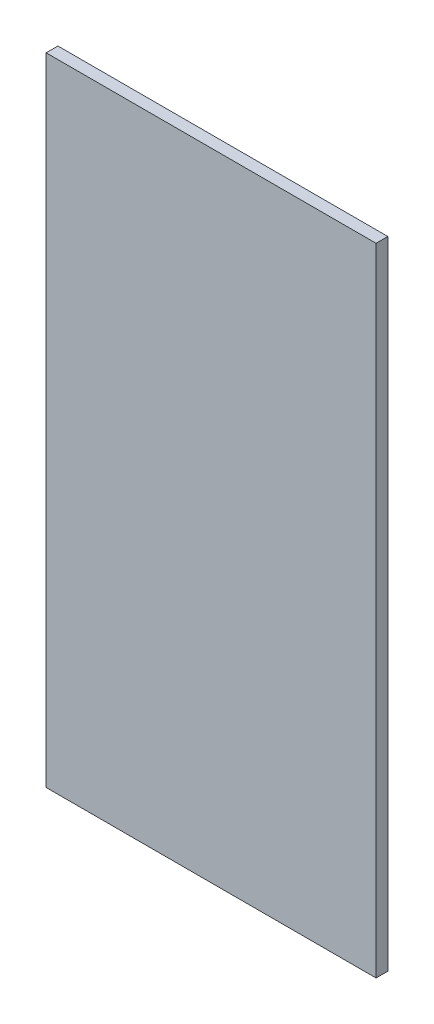
ISO-10303-21;
HEADER;
FILE_DESCRIPTION(('STEP AP214'),'2;1');
FILE_NAME('part.step','',(''),(''),'','','');
FILE_SCHEMA(('AUTOMOTIVE_DESIGN { 1 0 10303 214 1 1 1 1 }'));
ENDSEC;
DATA;
#1=APPLICATION_CONTEXT('core data for automotive mechanical design processes');
#2=APPLICATION_PROTOCOL_DEFINITION('international standard','automotive_design',2000,#1);
#3=PRODUCT_CONTEXT('',#1,'mechanical');
#4=PRODUCT('Part','Part','',(#3));
#5=PRODUCT_RELATED_PRODUCT_CATEGORY('part','',(#4));
#6=PRODUCT_DEFINITION_FORMATION('','',#4);
#7=PRODUCT_DEFINITION_CONTEXT('part definition',#1,'design');
#8=PRODUCT_DEFINITION('design','',#6,#7);
#9=PRODUCT_DEFINITION_SHAPE('','',#8);
#10=(LENGTH_UNIT() NAMED_UNIT(*) SI_UNIT(.MILLI.,.METRE.));
#11=(NAMED_UNIT(*) PLANE_ANGLE_UNIT() SI_UNIT($,.RADIAN.));
#12=(NAMED_UNIT(*) SI_UNIT($,.STERADIAN.) SOLID_ANGLE_UNIT());
#13=UNCERTAINTY_MEASURE_WITH_UNIT(LENGTH_MEASURE(1.E-05),#10,'distance_accuracy_value','');
#14=(GEOMETRIC_REPRESENTATION_CONTEXT(3) GLOBAL_UNCERTAINTY_ASSIGNED_CONTEXT((#13)) GLOBAL_UNIT_ASSIGNED_CONTEXT((#10,
#11,#12)) REPRESENTATION_CONTEXT('',''));
#15=CARTESIAN_POINT('',(0.,0.,0.));
#16=DIRECTION('',(0.,0.,1.));
#17=DIRECTION('',(1.,0.,0.));
#18=AXIS2_PLACEMENT_3D('',#15,#16,#17);
#19=CARTESIAN_POINT('',(-25.4,19.05,6.35));
#20=DIRECTION('',(1.,0.,0.));
#21=DIRECTION('',(0.,1.,0.));
#22=AXIS2_PLACEMENT_3D('',#19,#20,#21);
#23=PLANE('',#22);
#24=DIRECTION('',(0.,-1.,0.));
#25=VECTOR('',#24,1.);
#26=CARTESIAN_POINT('',(-25.4,19.05,0.));
#27=LINE('',#26,#25);
#28=CARTESIAN_POINT('',(-25.4,19.05,0.));
#29=VERTEX_POINT('',#28);
#30=CARTESIAN_POINT('',(-25.4,-323.85,0.));
#31=VERTEX_POINT('',#30);
#32=EDGE_CURVE('E80',#29,#31,#27,.T.);
#33=ORIENTED_EDGE('',*,*,#32,.T.);
#34=DIRECTION('',(0.,0.,-1.));
#35=VECTOR('',#34,1.);
#36=CARTESIAN_POINT('',(-25.4,-323.85,6.35));
#37=LINE('',#36,#35);
#38=CARTESIAN_POINT('',(-25.4,-323.85,6.35));
#39=VERTEX_POINT('',#38);
#40=EDGE_CURVE('E11',#39,#31,#37,.T.);
#41=ORIENTED_EDGE('',*,*,#40,.F.);
#42=DIRECTION('',(0.,-1.,0.));
#43=VECTOR('',#42,1.);
#44=CARTESIAN_POINT('',(-25.4,19.05,6.35));
#45=LINE('',#44,#43);
#46=CARTESIAN_POINT('',(-25.4,19.05,6.35));
#47=VERTEX_POINT('',#46);
#48=EDGE_CURVE('E68',#47,#39,#45,.T.);
#49=ORIENTED_EDGE('',*,*,#48,.F.);
#50=DIRECTION('',(0.,0.,-1.));
#51=VECTOR('',#50,1.);
#52=CARTESIAN_POINT('',(-25.4,19.05,6.35));
#53=LINE('',#52,#51);
#54=EDGE_CURVE('E76',#47,#29,#53,.T.);
#55=ORIENTED_EDGE('',*,*,#54,.T.);
#56=EDGE_LOOP('',(#33,#41,#49,#55));
#57=FACE_BOUND('',#56,.T.);
#58=ADVANCED_FACE('F17',(#57),#23,.F.);
#59=CARTESIAN_POINT('',(-25.4,-323.85,6.35));
#60=DIRECTION('',(0.,1.,0.));
#61=DIRECTION('',(0.,0.,1.));
#62=AXIS2_PLACEMENT_3D('',#59,#60,#61);
#63=PLANE('',#62);
#64=DIRECTION('',(1.,0.,0.));
#65=VECTOR('',#64,1.);
#66=CARTESIAN_POINT('',(-25.4,-323.85,0.));
#67=LINE('',#66,#65);
#68=CARTESIAN_POINT('',(152.4,-323.85,0.));
#69=VERTEX_POINT('',#68);
#70=EDGE_CURVE('E72',#31,#69,#67,.T.);
#71=ORIENTED_EDGE('',*,*,#70,.T.);
#72=DIRECTION('',(0.,0.,-1.));
#73=VECTOR('',#72,1.);
#74=CARTESIAN_POINT('',(152.4,-323.85,6.35));
#75=LINE('',#74,#73);
#76=CARTESIAN_POINT('',(152.4,-323.85,6.35));
#77=VERTEX_POINT('',#76);
#78=EDGE_CURVE('E25',#77,#69,#75,.T.);
#79=ORIENTED_EDGE('',*,*,#78,.F.);
#80=DIRECTION('',(1.,0.,0.));
#81=VECTOR('',#80,1.);
#82=CARTESIAN_POINT('',(-25.4,-323.85,6.35));
#83=LINE('',#82,#81);
#84=EDGE_CURVE('E63',#39,#77,#83,.T.);
#85=ORIENTED_EDGE('',*,*,#84,.F.);
#86=ORIENTED_EDGE('',*,*,#40,.T.);
#87=EDGE_LOOP('',(#71,#79,#85,#86));
#88=FACE_BOUND('',#87,.T.);
#89=ADVANCED_FACE('F71',(#88),#63,.F.);
#90=CARTESIAN_POINT('',(152.4,19.05,6.35));
#91=DIRECTION('',(-1.,0.,0.));
#92=DIRECTION('',(0.,-1.,0.));
#93=AXIS2_PLACEMENT_3D('',#90,#91,#92);
#94=PLANE('',#93);
#95=DIRECTION('',(0.,1.,0.));
#96=VECTOR('',#95,1.);
#97=CARTESIAN_POINT('',(152.4,19.05,0.));
#98=LINE('',#97,#96);
#99=CARTESIAN_POINT('',(152.4,19.05,0.));
#100=VERTEX_POINT('',#99);
#101=EDGE_CURVE('E50',#69,#100,#98,.T.);
#102=ORIENTED_EDGE('',*,*,#101,.T.);
#103=DIRECTION('',(0.,0.,-1.));
#104=VECTOR('',#103,1.);
#105=CARTESIAN_POINT('',(152.4,19.05,6.35));
#106=LINE('',#105,#104);
#107=CARTESIAN_POINT('',(152.4,19.05,6.35));
#108=VERTEX_POINT('',#107);
#109=EDGE_CURVE('E73',#108,#100,#106,.T.);
#110=ORIENTED_EDGE('',*,*,#109,.F.);
#111=DIRECTION('',(0.,1.,0.));
#112=VECTOR('',#111,1.);
#113=CARTESIAN_POINT('',(152.4,19.05,6.35));
#114=LINE('',#113,#112);
#115=EDGE_CURVE('E66',#77,#108,#114,.T.);
#116=ORIENTED_EDGE('',*,*,#115,.F.);
#117=ORIENTED_EDGE('',*,*,#78,.T.);
#118=EDGE_LOOP('',(#102,#110,#116,#117));
#119=FACE_BOUND('',#118,.T.);
#120=ADVANCED_FACE('F74',(#119),#94,.F.);
#121=CARTESIAN_POINT('',(-25.4,19.05,6.35));
#122=DIRECTION('',(0.,-1.,0.));
#123=DIRECTION('',(1.,0.,0.));
#124=AXIS2_PLACEMENT_3D('',#121,#122,#123);
#125=PLANE('',#124);
#126=DIRECTION('',(-1.,0.,0.));
#127=VECTOR('',#126,1.);
#128=CARTESIAN_POINT('',(-25.4,19.05,0.));
#129=LINE('',#128,#127);
#130=EDGE_CURVE('E56',#100,#29,#129,.T.);
#131=ORIENTED_EDGE('',*,*,#130,.T.);
#132=ORIENTED_EDGE('',*,*,#54,.F.);
#133=DIRECTION('',(-1.,0.,0.));
#134=VECTOR('',#133,1.);
#135=CARTESIAN_POINT('',(-25.4,19.05,6.35));
#136=LINE('',#135,#134);
#137=EDGE_CURVE('E33',#108,#47,#136,.T.);
#138=ORIENTED_EDGE('',*,*,#137,.F.);
#139=ORIENTED_EDGE('',*,*,#109,.T.);
#140=EDGE_LOOP('',(#131,#132,#138,#139));
#141=FACE_BOUND('',#140,.T.);
#142=ADVANCED_FACE('F87',(#141),#125,.F.);
#143=CARTESIAN_POINT('',(-25.4,-323.85,6.35));
#144=DIRECTION('',(0.,0.,1.));
#145=DIRECTION('',(1.,0.,0.));
#146=AXIS2_PLACEMENT_3D('',#143,#144,#145);
#147=PLANE('',#146);
#148=ORIENTED_EDGE('',*,*,#48,.T.);
#149=ORIENTED_EDGE('',*,*,#84,.T.);
#150=ORIENTED_EDGE('',*,*,#115,.T.);
#151=ORIENTED_EDGE('',*,*,#137,.T.);
#152=EDGE_LOOP('',(#148,#149,#150,#151));
#153=FACE_BOUND('',#152,.T.);
#154=ADVANCED_FACE('F64',(#153),#147,.T.);
#155=CARTESIAN_POINT('',(-25.4,-323.85,0.));
#156=DIRECTION('',(0.,0.,1.));
#157=DIRECTION('',(1.,0.,0.));
#158=AXIS2_PLACEMENT_3D('',#155,#156,#157);
#159=PLANE('',#158);
#160=ORIENTED_EDGE('',*,*,#32,.F.);
#161=ORIENTED_EDGE('',*,*,#130,.F.);
#162=ORIENTED_EDGE('',*,*,#101,.F.);
#163=ORIENTED_EDGE('',*,*,#70,.F.);
#164=EDGE_LOOP('',(#160,#161,#162,#163));
#165=FACE_BOUND('',#164,.T.);
#166=ADVANCED_FACE('F90',(#165),#159,.F.);
#167=CLOSED_SHELL('',(#58,#89,#120,#142,#154,#166));
#168=MANIFOLD_SOLID_BREP('B1',#167);
#169=ADVANCED_BREP_SHAPE_REPRESENTATION('',(#18,#168),#14);
#170=SHAPE_DEFINITION_REPRESENTATION(#9,#169);
ENDSEC;
END-ISO-10303-21;
